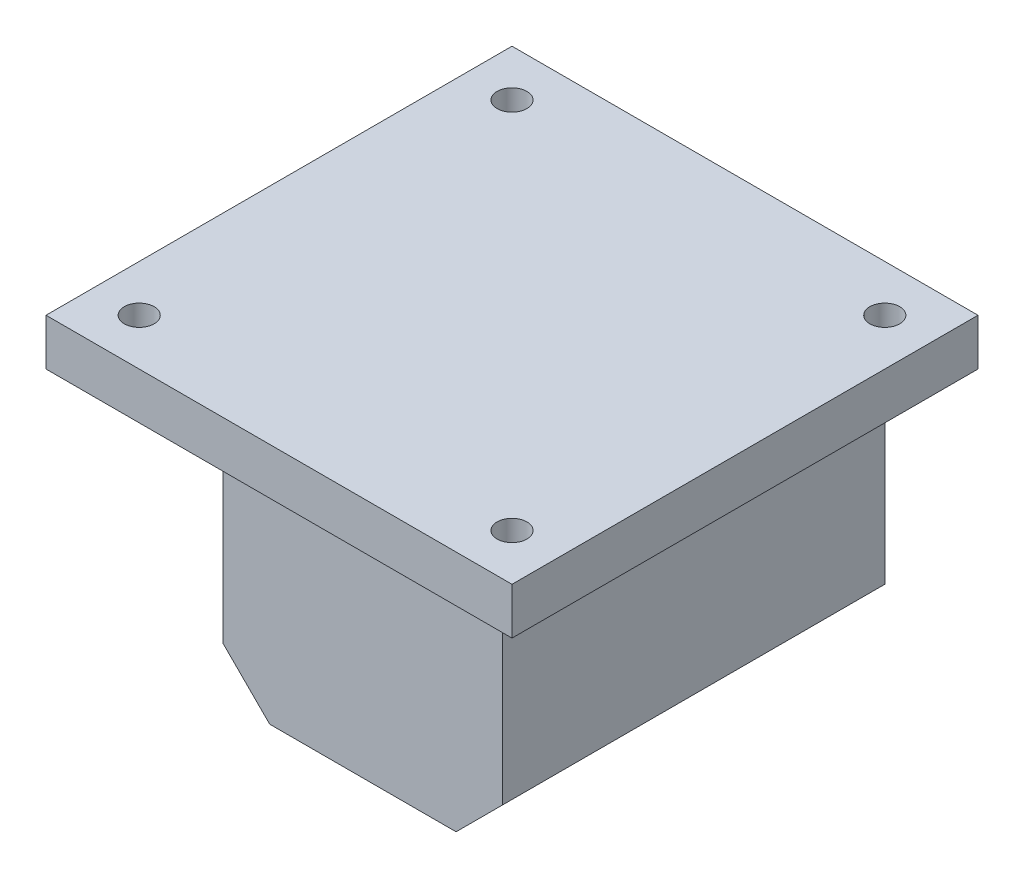
ISO-10303-21;
HEADER;
FILE_DESCRIPTION(('STEP AP214'),'2;1');
FILE_NAME('part.step','',(''),(''),'','','');
FILE_SCHEMA(('AUTOMOTIVE_DESIGN { 1 0 10303 214 1 1 1 1 }'));
ENDSEC;
DATA;
#1=APPLICATION_CONTEXT('core data for automotive mechanical design processes');
#2=APPLICATION_PROTOCOL_DEFINITION('international standard','automotive_design',2000,#1);
#3=PRODUCT_CONTEXT('',#1,'mechanical');
#4=PRODUCT('Part','Part','',(#3));
#5=PRODUCT_RELATED_PRODUCT_CATEGORY('part','',(#4));
#6=PRODUCT_DEFINITION_FORMATION('','',#4);
#7=PRODUCT_DEFINITION_CONTEXT('part definition',#1,'design');
#8=PRODUCT_DEFINITION('design','',#6,#7);
#9=PRODUCT_DEFINITION_SHAPE('','',#8);
#10=(LENGTH_UNIT() NAMED_UNIT(*) SI_UNIT(.MILLI.,.METRE.));
#11=(NAMED_UNIT(*) PLANE_ANGLE_UNIT() SI_UNIT($,.RADIAN.));
#12=(NAMED_UNIT(*) SI_UNIT($,.STERADIAN.) SOLID_ANGLE_UNIT());
#13=UNCERTAINTY_MEASURE_WITH_UNIT(LENGTH_MEASURE(1.E-05),#10,'distance_accuracy_value','');
#14=(GEOMETRIC_REPRESENTATION_CONTEXT(3) GLOBAL_UNCERTAINTY_ASSIGNED_CONTEXT((#13)) GLOBAL_UNIT_ASSIGNED_CONTEXT((#10,
#11,#12)) REPRESENTATION_CONTEXT('',''));
#15=CARTESIAN_POINT('',(0.,0.,0.));
#16=DIRECTION('',(0.,0.,1.));
#17=DIRECTION('',(1.,0.,0.));
#18=AXIS2_PLACEMENT_3D('',#15,#16,#17);
#19=CARTESIAN_POINT('',(0.,0.,0.));
#20=DIRECTION('',(0.,0.,-1.));
#21=DIRECTION('',(-1.,0.,0.));
#22=AXIS2_PLACEMENT_3D('',#19,#20,#21);
#23=PLANE('',#22);
#24=DIRECTION('',(0.,1.,0.));
#25=VECTOR('',#24,1.);
#26=CARTESIAN_POINT('',(15.,-15.,0.));
#27=LINE('',#26,#25);
#28=CARTESIAN_POINT('',(15.,-10.,0.));
#29=VERTEX_POINT('',#28);
#30=CARTESIAN_POINT('',(15.,15.,0.));
#31=VERTEX_POINT('',#30);
#32=EDGE_CURVE('E176',#29,#31,#27,.T.);
#33=ORIENTED_EDGE('',*,*,#32,.F.);
#34=DIRECTION('',(0.707106781186549,0.707106781186546,0.));
#35=VECTOR('',#34,1.);
#36=CARTESIAN_POINT('',(12.5,-12.5,0.));
#37=LINE('',#36,#35);
#38=CARTESIAN_POINT('',(9.99999999999999,-15.,0.));
#39=VERTEX_POINT('',#38);
#40=EDGE_CURVE('E192',#29,#39,#37,.F.);
#41=ORIENTED_EDGE('',*,*,#40,.T.);
#42=DIRECTION('',(1.,0.,0.));
#43=VECTOR('',#42,1.);
#44=CARTESIAN_POINT('',(-15.,-15.,0.));
#45=LINE('',#44,#43);
#46=CARTESIAN_POINT('',(-10.,-15.,0.));
#47=VERTEX_POINT('',#46);
#48=EDGE_CURVE('E180',#47,#39,#45,.T.);
#49=ORIENTED_EDGE('',*,*,#48,.F.);
#50=DIRECTION('',(0.707106781186546,-0.707106781186549,0.));
#51=VECTOR('',#50,1.);
#52=CARTESIAN_POINT('',(-12.5,-12.5,0.));
#53=LINE('',#52,#51);
#54=CARTESIAN_POINT('',(-15.,-9.99999999999999,0.));
#55=VERTEX_POINT('',#54);
#56=EDGE_CURVE('E190',#47,#55,#53,.F.);
#57=ORIENTED_EDGE('',*,*,#56,.T.);
#58=DIRECTION('',(0.,-1.,0.));
#59=VECTOR('',#58,1.);
#60=CARTESIAN_POINT('',(-15.,-15.,0.));
#61=LINE('',#60,#59);
#62=CARTESIAN_POINT('',(-15.,15.,0.));
#63=VERTEX_POINT('',#62);
#64=EDGE_CURVE('E178',#63,#55,#61,.T.);
#65=ORIENTED_EDGE('',*,*,#64,.F.);
#66=DIRECTION('',(-1.,0.,0.));
#67=VECTOR('',#66,1.);
#68=CARTESIAN_POINT('',(0.,15.,0.));
#69=LINE('',#68,#67);
#70=CARTESIAN_POINT('',(-25.,15.,0.));
#71=VERTEX_POINT('',#70);
#72=EDGE_CURVE('E133',#63,#71,#69,.T.);
#73=ORIENTED_EDGE('',*,*,#72,.T.);
#74=DIRECTION('',(0.,-1.,0.));
#75=VECTOR('',#74,1.);
#76=CARTESIAN_POINT('',(-25.,20.,0.));
#77=LINE('',#76,#75);
#78=CARTESIAN_POINT('',(-25.,20.,0.));
#79=VERTEX_POINT('',#78);
#80=EDGE_CURVE('E128',#79,#71,#77,.T.);
#81=ORIENTED_EDGE('',*,*,#80,.F.);
#82=DIRECTION('',(-1.,0.,0.));
#83=VECTOR('',#82,1.);
#84=CARTESIAN_POINT('',(25.,20.,0.));
#85=LINE('',#84,#83);
#86=CARTESIAN_POINT('',(25.,20.,0.));
#87=VERTEX_POINT('',#86);
#88=EDGE_CURVE('E114',#87,#79,#85,.T.);
#89=ORIENTED_EDGE('',*,*,#88,.F.);
#90=DIRECTION('',(0.,-1.,0.));
#91=VECTOR('',#90,1.);
#92=CARTESIAN_POINT('',(25.,20.,0.));
#93=LINE('',#92,#91);
#94=CARTESIAN_POINT('',(25.,15.,0.));
#95=VERTEX_POINT('',#94);
#96=EDGE_CURVE('E148',#87,#95,#93,.T.);
#97=ORIENTED_EDGE('',*,*,#96,.T.);
#98=EDGE_CURVE('E149',#95,#31,#69,.T.);
#99=ORIENTED_EDGE('',*,*,#98,.T.);
#100=EDGE_LOOP('',(#33,#41,#49,#57,#65,#73,#81,#89,#97,#99));
#101=FACE_BOUND('',#100,.T.);
#102=CARTESIAN_POINT('',(0.,0.,0.));
#103=DIRECTION('',(0.,0.,1.));
#104=DIRECTION('',(1.,0.,0.));
#105=AXIS2_PLACEMENT_3D('',#102,#103,#104);
#106=CIRCLE('',#105,2.65);
#107=CARTESIAN_POINT('',(2.65,0.,0.));
#108=VERTEX_POINT('',#107);
#109=EDGE_CURVE('E173',#108,#108,#106,.T.);
#110=ORIENTED_EDGE('',*,*,#109,.T.);
#111=EDGE_LOOP('',(#110));
#112=FACE_BOUND('',#111,.T.);
#113=ADVANCED_FACE('F35',(#101,#112),#23,.T.);
#114=CARTESIAN_POINT('',(15.,-15.,31.));
#115=DIRECTION('',(-1.,0.,0.));
#116=DIRECTION('',(0.,0.,1.));
#117=AXIS2_PLACEMENT_3D('',#114,#115,#116);
#118=PLANE('',#117);
#119=DIRECTION('',(0.,1.,0.));
#120=VECTOR('',#119,1.);
#121=CARTESIAN_POINT('',(15.,-15.,41.));
#122=LINE('',#121,#120);
#123=CARTESIAN_POINT('',(15.,-10.,41.));
#124=VERTEX_POINT('',#123);
#125=CARTESIAN_POINT('',(15.,15.,41.));
#126=VERTEX_POINT('',#125);
#127=EDGE_CURVE('E166',#124,#126,#122,.T.);
#128=ORIENTED_EDGE('',*,*,#127,.F.);
#129=DIRECTION('',(0.,0.,-1.));
#130=VECTOR('',#129,1.);
#131=CARTESIAN_POINT('',(15.,-10.,31.));
#132=LINE('',#131,#130);
#133=EDGE_CURVE('E187',#124,#29,#132,.T.);
#134=ORIENTED_EDGE('',*,*,#133,.T.);
#135=ORIENTED_EDGE('',*,*,#32,.T.);
#136=DIRECTION('',(0.,0.,-1.));
#137=VECTOR('',#136,1.);
#138=CARTESIAN_POINT('',(15.,15.,31.));
#139=LINE('',#138,#137);
#140=EDGE_CURVE('E184',#126,#31,#139,.T.);
#141=ORIENTED_EDGE('',*,*,#140,.F.);
#142=EDGE_LOOP('',(#128,#134,#135,#141));
#143=FACE_BOUND('',#142,.T.);
#144=ADVANCED_FACE('F207',(#143),#118,.F.);
#145=CARTESIAN_POINT('',(-15.,-15.,31.));
#146=DIRECTION('',(1.,0.,0.));
#147=DIRECTION('',(0.,0.,-1.));
#148=AXIS2_PLACEMENT_3D('',#145,#146,#147);
#149=PLANE('',#148);
#150=ORIENTED_EDGE('',*,*,#64,.T.);
#151=DIRECTION('',(0.,0.,1.));
#152=VECTOR('',#151,1.);
#153=CARTESIAN_POINT('',(-15.,-9.99999999999999,31.));
#154=LINE('',#153,#152);
#155=CARTESIAN_POINT('',(-15.,-9.99999999999999,41.));
#156=VERTEX_POINT('',#155);
#157=EDGE_CURVE('E11',#55,#156,#154,.T.);
#158=ORIENTED_EDGE('',*,*,#157,.T.);
#159=DIRECTION('',(0.,-1.,0.));
#160=VECTOR('',#159,1.);
#161=CARTESIAN_POINT('',(-15.,-15.,41.));
#162=LINE('',#161,#160);
#163=CARTESIAN_POINT('',(-15.,15.,41.));
#164=VERTEX_POINT('',#163);
#165=EDGE_CURVE('E136',#164,#156,#162,.T.);
#166=ORIENTED_EDGE('',*,*,#165,.F.);
#167=DIRECTION('',(0.,0.,-1.));
#168=VECTOR('',#167,1.);
#169=CARTESIAN_POINT('',(-15.,15.,31.));
#170=LINE('',#169,#168);
#171=EDGE_CURVE('E182',#164,#63,#170,.T.);
#172=ORIENTED_EDGE('',*,*,#171,.T.);
#173=EDGE_LOOP('',(#150,#158,#166,#172));
#174=FACE_BOUND('',#173,.T.);
#175=ADVANCED_FACE('F215',(#174),#149,.F.);
#176=CARTESIAN_POINT('',(-15.,-15.,31.));
#177=DIRECTION('',(0.,1.,0.));
#178=DIRECTION('',(0.,0.,1.));
#179=AXIS2_PLACEMENT_3D('',#176,#177,#178);
#180=PLANE('',#179);
#181=ORIENTED_EDGE('',*,*,#48,.T.);
#182=DIRECTION('',(0.,0.,1.));
#183=VECTOR('',#182,1.);
#184=CARTESIAN_POINT('',(9.99999999999999,-15.,31.));
#185=LINE('',#184,#183);
#186=CARTESIAN_POINT('',(9.99999999999999,-15.,41.));
#187=VERTEX_POINT('',#186);
#188=EDGE_CURVE('E57',#39,#187,#185,.T.);
#189=ORIENTED_EDGE('',*,*,#188,.T.);
#190=DIRECTION('',(1.,0.,0.));
#191=VECTOR('',#190,1.);
#192=CARTESIAN_POINT('',(15.,-15.,41.));
#193=LINE('',#192,#191);
#194=CARTESIAN_POINT('',(-10.,-15.,41.));
#195=VERTEX_POINT('',#194);
#196=EDGE_CURVE('E164',#195,#187,#193,.T.);
#197=ORIENTED_EDGE('',*,*,#196,.F.);
#198=DIRECTION('',(0.,0.,-1.));
#199=VECTOR('',#198,1.);
#200=CARTESIAN_POINT('',(-10.,-15.,31.));
#201=LINE('',#200,#199);
#202=EDGE_CURVE('E194',#195,#47,#201,.T.);
#203=ORIENTED_EDGE('',*,*,#202,.T.);
#204=EDGE_LOOP('',(#181,#189,#197,#203));
#205=FACE_BOUND('',#204,.T.);
#206=ADVANCED_FACE('F211',(#205),#180,.F.);
#207=CARTESIAN_POINT('',(0.,0.,31.));
#208=DIRECTION('',(0.,0.,-1.));
#209=DIRECTION('',(-1.,0.,0.));
#210=AXIS2_PLACEMENT_3D('',#207,#208,#209);
#211=CYLINDRICAL_SURFACE('',#210,2.65);
#212=CARTESIAN_POINT('',(0.,0.,31.));
#213=DIRECTION('',(0.,0.,1.));
#214=DIRECTION('',(1.,0.,0.));
#215=AXIS2_PLACEMENT_3D('',#212,#213,#214);
#216=CIRCLE('',#215,2.65);
#217=CARTESIAN_POINT('',(2.65,0.,31.));
#218=VERTEX_POINT('',#217);
#219=EDGE_CURVE('E170',#218,#218,#216,.T.);
#220=ORIENTED_EDGE('',*,*,#219,.T.);
#221=EDGE_LOOP('',(#220));
#222=FACE_BOUND('',#221,.T.);
#223=ORIENTED_EDGE('',*,*,#109,.F.);
#224=EDGE_LOOP('',(#223));
#225=FACE_BOUND('',#224,.T.);
#226=ADVANCED_FACE('F277',(#222,#225),#211,.F.);
#227=CARTESIAN_POINT('',(0.,0.,31.));
#228=DIRECTION('',(0.,0.,1.));
#229=DIRECTION('',(1.,0.,0.));
#230=AXIS2_PLACEMENT_3D('',#227,#228,#229);
#231=PLANE('',#230);
#232=ORIENTED_EDGE('',*,*,#219,.F.);
#233=EDGE_LOOP('',(#232));
#234=FACE_BOUND('',#233,.T.);
#235=ADVANCED_FACE('F305',(#234),#231,.F.);
#236=CARTESIAN_POINT('',(0.,0.,41.));
#237=DIRECTION('',(0.,0.,1.));
#238=DIRECTION('',(1.,0.,0.));
#239=AXIS2_PLACEMENT_3D('',#236,#237,#238);
#240=PLANE('',#239);
#241=ORIENTED_EDGE('',*,*,#196,.T.);
#242=DIRECTION('',(-0.707106781186549,-0.707106781186546,0.));
#243=VECTOR('',#242,1.);
#244=CARTESIAN_POINT('',(12.5,-12.5,41.));
#245=LINE('',#244,#243);
#246=EDGE_CURVE('E44',#187,#124,#245,.F.);
#247=ORIENTED_EDGE('',*,*,#246,.T.);
#248=ORIENTED_EDGE('',*,*,#127,.T.);
#249=DIRECTION('',(-1.,0.,0.));
#250=VECTOR('',#249,1.);
#251=CARTESIAN_POINT('',(15.,15.,41.));
#252=LINE('',#251,#250);
#253=EDGE_CURVE('E168',#126,#164,#252,.T.);
#254=ORIENTED_EDGE('',*,*,#253,.T.);
#255=ORIENTED_EDGE('',*,*,#165,.T.);
#256=DIRECTION('',(-0.707106781186546,0.707106781186549,0.));
#257=VECTOR('',#256,1.);
#258=CARTESIAN_POINT('',(-12.5,-12.5,41.));
#259=LINE('',#258,#257);
#260=EDGE_CURVE('E198',#156,#195,#259,.F.);
#261=ORIENTED_EDGE('',*,*,#260,.T.);
#262=EDGE_LOOP('',(#241,#247,#248,#254,#255,#261));
#263=FACE_BOUND('',#262,.T.);
#264=ADVANCED_FACE('F202',(#263),#240,.T.);
#265=CARTESIAN_POINT('',(-25.,20.,0.));
#266=DIRECTION('',(1.,0.,0.));
#267=DIRECTION('',(0.,0.,-1.));
#268=AXIS2_PLACEMENT_3D('',#265,#266,#267);
#269=PLANE('',#268);
#270=DIRECTION('',(0.,0.,1.));
#271=VECTOR('',#270,1.);
#272=CARTESIAN_POINT('',(-25.,15.,0.));
#273=LINE('',#272,#271);
#274=CARTESIAN_POINT('',(-25.,15.,50.));
#275=VERTEX_POINT('',#274);
#276=EDGE_CURVE('E152',#71,#275,#273,.T.);
#277=ORIENTED_EDGE('',*,*,#276,.T.);
#278=DIRECTION('',(0.,-1.,0.));
#279=VECTOR('',#278,1.);
#280=CARTESIAN_POINT('',(-25.,20.,50.));
#281=LINE('',#280,#279);
#282=CARTESIAN_POINT('',(-25.,20.,50.));
#283=VERTEX_POINT('',#282);
#284=EDGE_CURVE('E137',#283,#275,#281,.T.);
#285=ORIENTED_EDGE('',*,*,#284,.F.);
#286=DIRECTION('',(0.,0.,1.));
#287=VECTOR('',#286,1.);
#288=CARTESIAN_POINT('',(-25.,20.,0.));
#289=LINE('',#288,#287);
#290=EDGE_CURVE('E118',#79,#283,#289,.T.);
#291=ORIENTED_EDGE('',*,*,#290,.F.);
#292=ORIENTED_EDGE('',*,*,#80,.T.);
#293=EDGE_LOOP('',(#277,#285,#291,#292));
#294=FACE_BOUND('',#293,.T.);
#295=ADVANCED_FACE('F139',(#294),#269,.F.);
#296=CARTESIAN_POINT('',(-25.,20.,50.));
#297=DIRECTION('',(0.,0.,-1.));
#298=DIRECTION('',(-1.,0.,0.));
#299=AXIS2_PLACEMENT_3D('',#296,#297,#298);
#300=PLANE('',#299);
#301=DIRECTION('',(1.,0.,0.));
#302=VECTOR('',#301,1.);
#303=CARTESIAN_POINT('',(-25.,15.,50.));
#304=LINE('',#303,#302);
#305=CARTESIAN_POINT('',(25.,15.,50.));
#306=VERTEX_POINT('',#305);
#307=EDGE_CURVE('E154',#275,#306,#304,.T.);
#308=ORIENTED_EDGE('',*,*,#307,.T.);
#309=DIRECTION('',(0.,-1.,0.));
#310=VECTOR('',#309,1.);
#311=CARTESIAN_POINT('',(25.,20.,50.));
#312=LINE('',#311,#310);
#313=CARTESIAN_POINT('',(25.,20.,50.));
#314=VERTEX_POINT('',#313);
#315=EDGE_CURVE('E159',#314,#306,#312,.T.);
#316=ORIENTED_EDGE('',*,*,#315,.F.);
#317=DIRECTION('',(1.,0.,0.));
#318=VECTOR('',#317,1.);
#319=CARTESIAN_POINT('',(-25.,20.,50.));
#320=LINE('',#319,#318);
#321=EDGE_CURVE('E142',#283,#314,#320,.T.);
#322=ORIENTED_EDGE('',*,*,#321,.F.);
#323=ORIENTED_EDGE('',*,*,#284,.T.);
#324=EDGE_LOOP('',(#308,#316,#322,#323));
#325=FACE_BOUND('',#324,.T.);
#326=ADVANCED_FACE('F298',(#325),#300,.F.);
#327=CARTESIAN_POINT('',(25.,20.,50.));
#328=DIRECTION('',(-1.,0.,0.));
#329=DIRECTION('',(0.,0.,1.));
#330=AXIS2_PLACEMENT_3D('',#327,#328,#329);
#331=PLANE('',#330);
#332=DIRECTION('',(0.,0.,-1.));
#333=VECTOR('',#332,1.);
#334=CARTESIAN_POINT('',(25.,15.,50.));
#335=LINE('',#334,#333);
#336=EDGE_CURVE('E125',#306,#95,#335,.T.);
#337=ORIENTED_EDGE('',*,*,#336,.T.);
#338=ORIENTED_EDGE('',*,*,#96,.F.);
#339=DIRECTION('',(0.,0.,-1.));
#340=VECTOR('',#339,1.);
#341=CARTESIAN_POINT('',(25.,20.,50.));
#342=LINE('',#341,#340);
#343=EDGE_CURVE('E121',#314,#87,#342,.T.);
#344=ORIENTED_EDGE('',*,*,#343,.F.);
#345=ORIENTED_EDGE('',*,*,#315,.T.);
#346=EDGE_LOOP('',(#337,#338,#344,#345));
#347=FACE_BOUND('',#346,.T.);
#348=ADVANCED_FACE('F252',(#347),#331,.F.);
#349=CARTESIAN_POINT('',(0.,20.,0.));
#350=DIRECTION('',(0.,1.,0.));
#351=DIRECTION('',(0.,0.,1.));
#352=AXIS2_PLACEMENT_3D('',#349,#350,#351);
#353=PLANE('',#352);
#354=CARTESIAN_POINT('',(-19.9999999999996,20.,45.));
#355=DIRECTION('',(0.,1.,0.));
#356=DIRECTION('',(0.,0.,1.));
#357=AXIS2_PLACEMENT_3D('',#354,#355,#356);
#358=CIRCLE('',#357,1.6);
#359=CARTESIAN_POINT('',(-19.9999999999996,20.,46.6));
#360=VERTEX_POINT('',#359);
#361=EDGE_CURVE('E233',#360,#360,#358,.T.);
#362=ORIENTED_EDGE('',*,*,#361,.F.);
#363=EDGE_LOOP('',(#362));
#364=FACE_BOUND('',#363,.T.);
#365=CARTESIAN_POINT('',(20.0000000000004,20.,45.));
#366=DIRECTION('',(0.,1.,0.));
#367=DIRECTION('',(0.,0.,1.));
#368=AXIS2_PLACEMENT_3D('',#365,#366,#367);
#369=CIRCLE('',#368,1.6);
#370=CARTESIAN_POINT('',(20.0000000000004,20.,46.6));
#371=VERTEX_POINT('',#370);
#372=EDGE_CURVE('E232',#371,#371,#369,.T.);
#373=ORIENTED_EDGE('',*,*,#372,.F.);
#374=EDGE_LOOP('',(#373));
#375=FACE_BOUND('',#374,.T.);
#376=CARTESIAN_POINT('',(20.,20.,5.));
#377=DIRECTION('',(0.,1.,0.));
#378=DIRECTION('',(0.,0.,1.));
#379=AXIS2_PLACEMENT_3D('',#376,#377,#378);
#380=CIRCLE('',#379,1.6);
#381=CARTESIAN_POINT('',(20.,20.,6.6));
#382=VERTEX_POINT('',#381);
#383=EDGE_CURVE('E239',#382,#382,#380,.T.);
#384=ORIENTED_EDGE('',*,*,#383,.F.);
#385=EDGE_LOOP('',(#384));
#386=FACE_BOUND('',#385,.T.);
#387=CARTESIAN_POINT('',(-20.,20.,5.));
#388=DIRECTION('',(0.,1.,0.));
#389=DIRECTION('',(0.,0.,1.));
#390=AXIS2_PLACEMENT_3D('',#387,#388,#389);
#391=CIRCLE('',#390,1.6);
#392=CARTESIAN_POINT('',(-20.,20.,6.6));
#393=VERTEX_POINT('',#392);
#394=EDGE_CURVE('E222',#393,#393,#391,.T.);
#395=ORIENTED_EDGE('',*,*,#394,.F.);
#396=EDGE_LOOP('',(#395));
#397=FACE_BOUND('',#396,.T.);
#398=ORIENTED_EDGE('',*,*,#88,.T.);
#399=ORIENTED_EDGE('',*,*,#290,.T.);
#400=ORIENTED_EDGE('',*,*,#321,.T.);
#401=ORIENTED_EDGE('',*,*,#343,.T.);
#402=EDGE_LOOP('',(#398,#399,#400,#401));
#403=FACE_BOUND('',#402,.T.);
#404=ADVANCED_FACE('F116',(#364,#375,#386,#397,#403),#353,.T.);
#405=CARTESIAN_POINT('',(0.,15.,0.));
#406=DIRECTION('',(0.,1.,0.));
#407=DIRECTION('',(0.,0.,1.));
#408=AXIS2_PLACEMENT_3D('',#405,#406,#407);
#409=PLANE('',#408);
#410=CARTESIAN_POINT('',(-19.9999999999996,15.,45.));
#411=DIRECTION('',(0.,1.,0.));
#412=DIRECTION('',(0.,0.,1.));
#413=AXIS2_PLACEMENT_3D('',#410,#411,#412);
#414=CIRCLE('',#413,1.6);
#415=CARTESIAN_POINT('',(-19.9999999999996,15.,46.6));
#416=VERTEX_POINT('',#415);
#417=EDGE_CURVE('E229',#416,#416,#414,.F.);
#418=ORIENTED_EDGE('',*,*,#417,.F.);
#419=EDGE_LOOP('',(#418));
#420=FACE_BOUND('',#419,.T.);
#421=CARTESIAN_POINT('',(20.0000000000004,15.,45.));
#422=DIRECTION('',(0.,1.,0.));
#423=DIRECTION('',(0.,0.,1.));
#424=AXIS2_PLACEMENT_3D('',#421,#422,#423);
#425=CIRCLE('',#424,1.6);
#426=CARTESIAN_POINT('',(20.0000000000004,15.,46.6));
#427=VERTEX_POINT('',#426);
#428=EDGE_CURVE('E236',#427,#427,#425,.F.);
#429=ORIENTED_EDGE('',*,*,#428,.F.);
#430=EDGE_LOOP('',(#429));
#431=FACE_BOUND('',#430,.T.);
#432=CARTESIAN_POINT('',(20.,15.,5.));
#433=DIRECTION('',(0.,1.,0.));
#434=DIRECTION('',(0.,0.,1.));
#435=AXIS2_PLACEMENT_3D('',#432,#433,#434);
#436=CIRCLE('',#435,1.6);
#437=CARTESIAN_POINT('',(20.,15.,6.6));
#438=VERTEX_POINT('',#437);
#439=EDGE_CURVE('E226',#438,#438,#436,.F.);
#440=ORIENTED_EDGE('',*,*,#439,.F.);
#441=EDGE_LOOP('',(#440));
#442=FACE_BOUND('',#441,.T.);
#443=CARTESIAN_POINT('',(-20.,15.,5.));
#444=DIRECTION('',(0.,1.,0.));
#445=DIRECTION('',(0.,0.,1.));
#446=AXIS2_PLACEMENT_3D('',#443,#444,#445);
#447=CIRCLE('',#446,1.6);
#448=CARTESIAN_POINT('',(-20.,15.,6.6));
#449=VERTEX_POINT('',#448);
#450=EDGE_CURVE('E220',#449,#449,#447,.F.);
#451=ORIENTED_EDGE('',*,*,#450,.F.);
#452=EDGE_LOOP('',(#451));
#453=FACE_BOUND('',#452,.T.);
#454=ORIENTED_EDGE('',*,*,#171,.F.);
#455=ORIENTED_EDGE('',*,*,#253,.F.);
#456=ORIENTED_EDGE('',*,*,#140,.T.);
#457=ORIENTED_EDGE('',*,*,#98,.F.);
#458=ORIENTED_EDGE('',*,*,#336,.F.);
#459=ORIENTED_EDGE('',*,*,#307,.F.);
#460=ORIENTED_EDGE('',*,*,#276,.F.);
#461=ORIENTED_EDGE('',*,*,#72,.F.);
#462=EDGE_LOOP('',(#454,#455,#456,#457,#458,#459,#460,#461));
#463=FACE_BOUND('',#462,.T.);
#464=ADVANCED_FACE('F218',(#420,#431,#442,#453,#463),#409,.F.);
#465=CARTESIAN_POINT('',(15.,-10.,31.));
#466=DIRECTION('',(-0.707106781186546,0.707106781186549,0.));
#467=DIRECTION('',(0.,0.,-1.));
#468=AXIS2_PLACEMENT_3D('',#465,#466,#467);
#469=PLANE('',#468);
#470=ORIENTED_EDGE('',*,*,#246,.F.);
#471=ORIENTED_EDGE('',*,*,#188,.F.);
#472=ORIENTED_EDGE('',*,*,#40,.F.);
#473=ORIENTED_EDGE('',*,*,#133,.F.);
#474=EDGE_LOOP('',(#470,#471,#472,#473));
#475=FACE_BOUND('',#474,.T.);
#476=ADVANCED_FACE('F209',(#475),#469,.F.);
#477=CARTESIAN_POINT('',(-10.,-15.,31.));
#478=DIRECTION('',(0.707106781186549,0.707106781186546,0.));
#479=DIRECTION('',(0.,0.,-1.));
#480=AXIS2_PLACEMENT_3D('',#477,#478,#479);
#481=PLANE('',#480);
#482=ORIENTED_EDGE('',*,*,#260,.F.);
#483=ORIENTED_EDGE('',*,*,#157,.F.);
#484=ORIENTED_EDGE('',*,*,#56,.F.);
#485=ORIENTED_EDGE('',*,*,#202,.F.);
#486=EDGE_LOOP('',(#482,#483,#484,#485));
#487=FACE_BOUND('',#486,.T.);
#488=ADVANCED_FACE('F38',(#487),#481,.F.);
#489=CARTESIAN_POINT('',(-20.,-15.001,5.));
#490=DIRECTION('',(0.,1.,0.));
#491=DIRECTION('',(0.,0.,1.));
#492=AXIS2_PLACEMENT_3D('',#489,#490,#491);
#493=CYLINDRICAL_SURFACE('',#492,1.6);
#494=ORIENTED_EDGE('',*,*,#394,.T.);
#495=EDGE_LOOP('',(#494));
#496=FACE_BOUND('',#495,.T.);
#497=ORIENTED_EDGE('',*,*,#450,.T.);
#498=EDGE_LOOP('',(#497));
#499=FACE_BOUND('',#498,.T.);
#500=ADVANCED_FACE('F257',(#496,#499),#493,.F.);
#501=CARTESIAN_POINT('',(20.,-15.001,5.));
#502=DIRECTION('',(0.,1.,0.));
#503=DIRECTION('',(0.,0.,1.));
#504=AXIS2_PLACEMENT_3D('',#501,#502,#503);
#505=CYLINDRICAL_SURFACE('',#504,1.6);
#506=ORIENTED_EDGE('',*,*,#383,.T.);
#507=EDGE_LOOP('',(#506));
#508=FACE_BOUND('',#507,.T.);
#509=ORIENTED_EDGE('',*,*,#439,.T.);
#510=EDGE_LOOP('',(#509));
#511=FACE_BOUND('',#510,.T.);
#512=ADVANCED_FACE('F247',(#508,#511),#505,.F.);
#513=CARTESIAN_POINT('',(20.0000000000004,-15.001,45.));
#514=DIRECTION('',(0.,1.,0.));
#515=DIRECTION('',(0.,0.,1.));
#516=AXIS2_PLACEMENT_3D('',#513,#514,#515);
#517=CYLINDRICAL_SURFACE('',#516,1.6);
#518=ORIENTED_EDGE('',*,*,#372,.T.);
#519=EDGE_LOOP('',(#518));
#520=FACE_BOUND('',#519,.T.);
#521=ORIENTED_EDGE('',*,*,#428,.T.);
#522=EDGE_LOOP('',(#521));
#523=FACE_BOUND('',#522,.T.);
#524=ADVANCED_FACE('F264',(#520,#523),#517,.F.);
#525=CARTESIAN_POINT('',(-19.9999999999996,-15.001,45.));
#526=DIRECTION('',(0.,1.,0.));
#527=DIRECTION('',(0.,0.,1.));
#528=AXIS2_PLACEMENT_3D('',#525,#526,#527);
#529=CYLINDRICAL_SURFACE('',#528,1.6);
#530=ORIENTED_EDGE('',*,*,#361,.T.);
#531=EDGE_LOOP('',(#530));
#532=FACE_BOUND('',#531,.T.);
#533=ORIENTED_EDGE('',*,*,#417,.T.);
#534=EDGE_LOOP('',(#533));
#535=FACE_BOUND('',#534,.T.);
#536=ADVANCED_FACE('F420',(#532,#535),#529,.F.);
#537=CLOSED_SHELL('',(#113,#144,#175,#206,#226,#235,#264,#295,#326,#348,#404,#464,#476,#488,
#500,#512,#524,#536));
#538=MANIFOLD_SOLID_BREP('B2',#537);
#539=ADVANCED_BREP_SHAPE_REPRESENTATION('',(#18,#538),#14);
#540=SHAPE_DEFINITION_REPRESENTATION(#9,#539);
ENDSEC;
END-ISO-10303-21;
